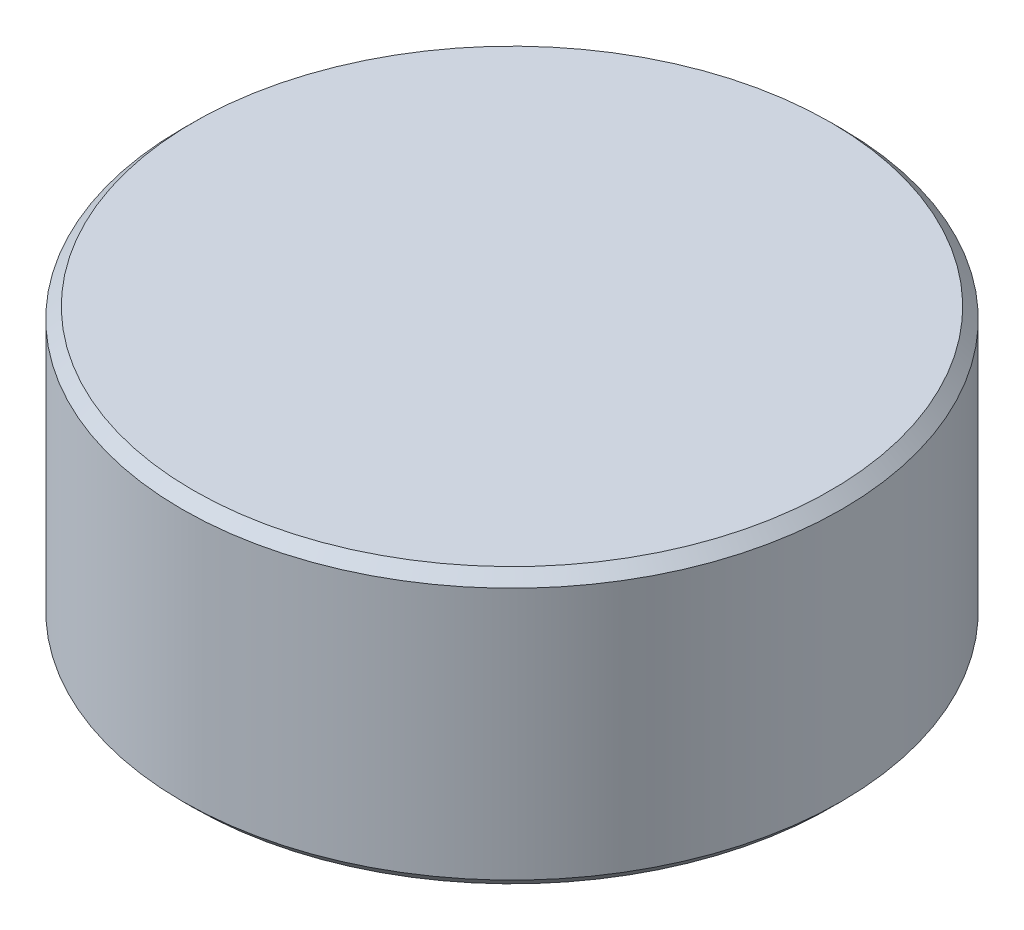
ISO-10303-21;
HEADER;
FILE_DESCRIPTION(('STEP AP214'),'2;1');
FILE_NAME('part.step','',(''),(''),'','','');
FILE_SCHEMA(('AUTOMOTIVE_DESIGN { 1 0 10303 214 1 1 1 1 }'));
ENDSEC;
DATA;
#1=APPLICATION_CONTEXT('core data for automotive mechanical design processes');
#2=APPLICATION_PROTOCOL_DEFINITION('international standard','automotive_design',2000,#1);
#3=PRODUCT_CONTEXT('',#1,'mechanical');
#4=PRODUCT('Part','Part','',(#3));
#5=PRODUCT_RELATED_PRODUCT_CATEGORY('part','',(#4));
#6=PRODUCT_DEFINITION_FORMATION('','',#4);
#7=PRODUCT_DEFINITION_CONTEXT('part definition',#1,'design');
#8=PRODUCT_DEFINITION('design','',#6,#7);
#9=PRODUCT_DEFINITION_SHAPE('','',#8);
#10=(LENGTH_UNIT() NAMED_UNIT(*) SI_UNIT(.MILLI.,.METRE.));
#11=(NAMED_UNIT(*) PLANE_ANGLE_UNIT() SI_UNIT($,.RADIAN.));
#12=(NAMED_UNIT(*) SI_UNIT($,.STERADIAN.) SOLID_ANGLE_UNIT());
#13=UNCERTAINTY_MEASURE_WITH_UNIT(LENGTH_MEASURE(1.E-05),#10,'distance_accuracy_value','');
#14=(GEOMETRIC_REPRESENTATION_CONTEXT(3) GLOBAL_UNCERTAINTY_ASSIGNED_CONTEXT((#13)) GLOBAL_UNIT_ASSIGNED_CONTEXT((#10,
#11,#12)) REPRESENTATION_CONTEXT('',''));
#15=CARTESIAN_POINT('',(0.,0.,0.));
#16=DIRECTION('',(0.,0.,1.));
#17=DIRECTION('',(1.,0.,0.));
#18=AXIS2_PLACEMENT_3D('',#15,#16,#17);
#19=CARTESIAN_POINT('',(0.,1.25,0.));
#20=DIRECTION('',(0.,-1.,0.));
#21=DIRECTION('',(0.,0.,-1.));
#22=AXIS2_PLACEMENT_3D('',#19,#20,#21);
#23=CYLINDRICAL_SURFACE('',#22,3.);
#24=CARTESIAN_POINT('',(0.,-1.15,0.));
#25=DIRECTION('',(0.,1.,0.));
#26=DIRECTION('',(0.,0.,1.));
#27=AXIS2_PLACEMENT_3D('',#24,#25,#26);
#28=CIRCLE('',#27,3.);
#29=CARTESIAN_POINT('',(0.,-1.15,3.));
#30=VERTEX_POINT('',#29);
#31=EDGE_CURVE('E59',#30,#30,#28,.T.);
#32=ORIENTED_EDGE('',*,*,#31,.T.);
#33=EDGE_LOOP('',(#32));
#34=FACE_BOUND('',#33,.T.);
#35=CARTESIAN_POINT('',(0.,1.15,0.));
#36=DIRECTION('',(0.,1.,0.));
#37=DIRECTION('',(0.,0.,1.));
#38=AXIS2_PLACEMENT_3D('',#35,#36,#37);
#39=CIRCLE('',#38,3.);
#40=CARTESIAN_POINT('',(0.,1.15,3.));
#41=VERTEX_POINT('',#40);
#42=EDGE_CURVE('E64',#41,#41,#39,.F.);
#43=ORIENTED_EDGE('',*,*,#42,.T.);
#44=EDGE_LOOP('',(#43));
#45=FACE_BOUND('',#44,.T.);
#46=ADVANCED_FACE('F45',(#34,#45),#23,.T.);
#47=CARTESIAN_POINT('',(0.,1.25,0.));
#48=DIRECTION('',(0.,1.,0.));
#49=DIRECTION('',(0.,0.,1.));
#50=AXIS2_PLACEMENT_3D('',#47,#48,#49);
#51=PLANE('',#50);
#52=CARTESIAN_POINT('',(0.,1.25,0.));
#53=DIRECTION('',(0.,1.,0.));
#54=DIRECTION('',(0.,0.,1.));
#55=AXIS2_PLACEMENT_3D('',#52,#53,#54);
#56=CIRCLE('',#55,2.9);
#57=CARTESIAN_POINT('',(0.,1.25,2.9));
#58=VERTEX_POINT('',#57);
#59=EDGE_CURVE('E10',#58,#58,#56,.T.);
#60=ORIENTED_EDGE('',*,*,#59,.T.);
#61=EDGE_LOOP('',(#60));
#62=FACE_BOUND('',#61,.T.);
#63=ADVANCED_FACE('F81',(#62),#51,.T.);
#64=CARTESIAN_POINT('',(0.,-1.25,0.));
#65=DIRECTION('',(0.,1.,0.));
#66=DIRECTION('',(0.,0.,1.));
#67=AXIS2_PLACEMENT_3D('',#64,#65,#66);
#68=PLANE('',#67);
#69=CARTESIAN_POINT('',(0.,-1.25,0.));
#70=DIRECTION('',(0.,1.,0.));
#71=DIRECTION('',(0.,0.,1.));
#72=AXIS2_PLACEMENT_3D('',#69,#70,#71);
#73=CIRCLE('',#72,2.9);
#74=CARTESIAN_POINT('',(0.,-1.25,2.9));
#75=VERTEX_POINT('',#74);
#76=EDGE_CURVE('E54',#75,#75,#73,.F.);
#77=ORIENTED_EDGE('',*,*,#76,.T.);
#78=EDGE_LOOP('',(#77));
#79=FACE_BOUND('',#78,.T.);
#80=ADVANCED_FACE('F78',(#79),#68,.F.);
#81=CARTESIAN_POINT('',(0.,-1.15,0.));
#82=DIRECTION('',(0.,1.,0.));
#83=DIRECTION('',(0.,0.,1.));
#84=AXIS2_PLACEMENT_3D('',#81,#82,#83);
#85=CONICAL_SURFACE('',#84,3.,0.785398163397455);
#86=ORIENTED_EDGE('',*,*,#76,.F.);
#87=EDGE_LOOP('',(#86));
#88=FACE_BOUND('',#87,.T.);
#89=ORIENTED_EDGE('',*,*,#31,.F.);
#90=EDGE_LOOP('',(#89));
#91=FACE_BOUND('',#90,.T.);
#92=ADVANCED_FACE('F74',(#88,#91),#85,.T.);
#93=CARTESIAN_POINT('',(0.,1.25,0.));
#94=DIRECTION('',(0.,-1.,0.));
#95=DIRECTION('',(0.,0.,-1.));
#96=AXIS2_PLACEMENT_3D('',#93,#94,#95);
#97=CONICAL_SURFACE('',#96,2.9,0.785398163397444);
#98=ORIENTED_EDGE('',*,*,#42,.F.);
#99=EDGE_LOOP('',(#98));
#100=FACE_BOUND('',#99,.T.);
#101=ORIENTED_EDGE('',*,*,#59,.F.);
#102=EDGE_LOOP('',(#101));
#103=FACE_BOUND('',#102,.T.);
#104=ADVANCED_FACE('F48',(#100,#103),#97,.T.);
#105=CLOSED_SHELL('',(#46,#63,#80,#92,#104));
#106=MANIFOLD_SOLID_BREP('B2',#105);
#107=ADVANCED_BREP_SHAPE_REPRESENTATION('',(#18,#106),#14);
#108=SHAPE_DEFINITION_REPRESENTATION(#9,#107);
ENDSEC;
END-ISO-10303-21;
